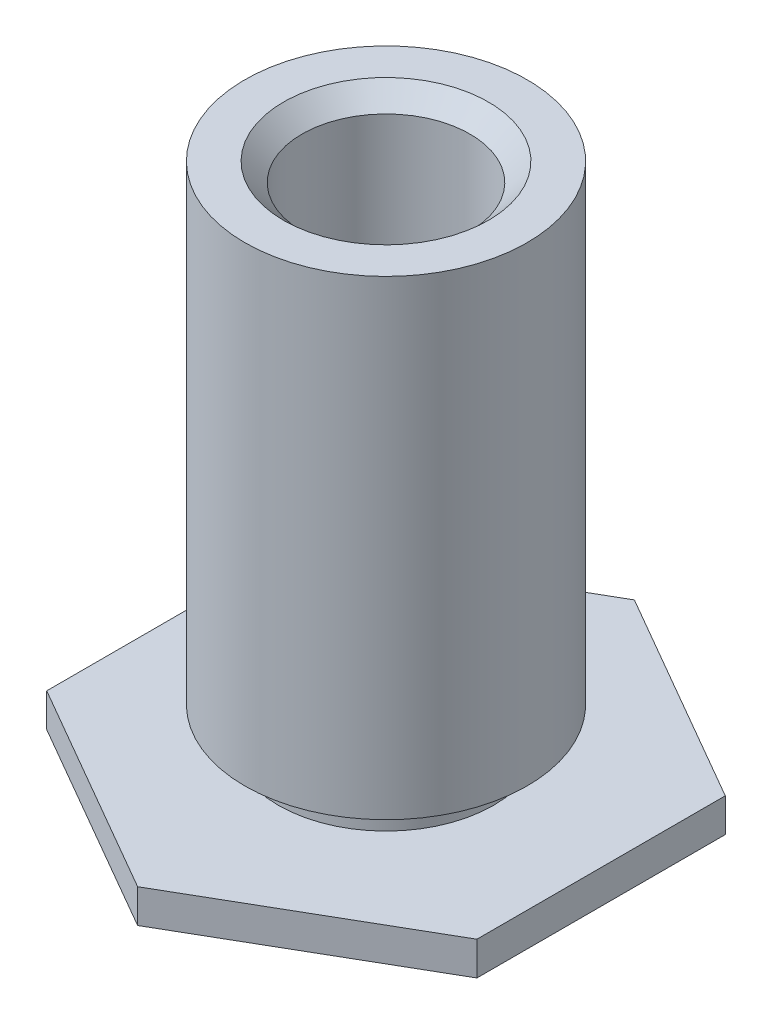
ISO-10303-21;
HEADER;
FILE_DESCRIPTION(('STEP AP214'),'2;1');
FILE_NAME('part.step','',(''),(''),'','','');
FILE_SCHEMA(('AUTOMOTIVE_DESIGN { 1 0 10303 214 1 1 1 1 }'));
ENDSEC;
DATA;
#1=APPLICATION_CONTEXT('core data for automotive mechanical design processes');
#2=APPLICATION_PROTOCOL_DEFINITION('international standard','automotive_design',2000,#1);
#3=PRODUCT_CONTEXT('',#1,'mechanical');
#4=PRODUCT('Part','Part','',(#3));
#5=PRODUCT_RELATED_PRODUCT_CATEGORY('part','',(#4));
#6=PRODUCT_DEFINITION_FORMATION('','',#4);
#7=PRODUCT_DEFINITION_CONTEXT('part definition',#1,'design');
#8=PRODUCT_DEFINITION('design','',#6,#7);
#9=PRODUCT_DEFINITION_SHAPE('','',#8);
#10=(LENGTH_UNIT() NAMED_UNIT(*) SI_UNIT(.MILLI.,.METRE.));
#11=(NAMED_UNIT(*) PLANE_ANGLE_UNIT() SI_UNIT($,.RADIAN.));
#12=(NAMED_UNIT(*) SI_UNIT($,.STERADIAN.) SOLID_ANGLE_UNIT());
#13=UNCERTAINTY_MEASURE_WITH_UNIT(LENGTH_MEASURE(1.E-05),#10,'distance_accuracy_value','');
#14=(GEOMETRIC_REPRESENTATION_CONTEXT(3) GLOBAL_UNCERTAINTY_ASSIGNED_CONTEXT((#13)) GLOBAL_UNIT_ASSIGNED_CONTEXT((#10,
#11,#12)) REPRESENTATION_CONTEXT('',''));
#15=CARTESIAN_POINT('',(0.,0.,0.));
#16=DIRECTION('',(0.,0.,1.));
#17=DIRECTION('',(1.,0.,0.));
#18=AXIS2_PLACEMENT_3D('',#15,#16,#17);
#19=CARTESIAN_POINT('',(0.,8.,0.));
#20=DIRECTION('',(0.,1.,0.));
#21=DIRECTION('',(0.,0.,1.));
#22=AXIS2_PLACEMENT_3D('',#19,#20,#21);
#23=PLANE('',#22);
#24=CARTESIAN_POINT('',(0.,8.,0.));
#25=DIRECTION('',(0.,1.,0.));
#26=DIRECTION('',(0.,0.,1.));
#27=AXIS2_PLACEMENT_3D('',#24,#25,#26);
#28=CIRCLE('',#27,1.525);
#29=CARTESIAN_POINT('',(0.,8.,1.525));
#30=VERTEX_POINT('',#29);
#31=EDGE_CURVE('E143',#30,#30,#28,.T.);
#32=ORIENTED_EDGE('',*,*,#31,.F.);
#33=EDGE_LOOP('',(#32));
#34=FACE_BOUND('',#33,.T.);
#35=CARTESIAN_POINT('',(0.,8.,0.));
#36=DIRECTION('',(0.,1.,0.));
#37=DIRECTION('',(0.,0.,1.));
#38=AXIS2_PLACEMENT_3D('',#35,#36,#37);
#39=CIRCLE('',#38,2.1);
#40=CARTESIAN_POINT('',(0.,8.,2.1));
#41=VERTEX_POINT('',#40);
#42=EDGE_CURVE('E146',#41,#41,#39,.T.);
#43=ORIENTED_EDGE('',*,*,#42,.T.);
#44=EDGE_LOOP('',(#43));
#45=FACE_BOUND('',#44,.T.);
#46=ADVANCED_FACE('F37',(#34,#45),#23,.T.);
#47=CARTESIAN_POINT('',(0.,0.5,0.));
#48=DIRECTION('',(0.,1.,0.));
#49=DIRECTION('',(0.,0.,1.));
#50=AXIS2_PLACEMENT_3D('',#47,#48,#49);
#51=PLANE('',#50);
#52=DIRECTION('',(-0.866025403784438,0.,0.5));
#53=VECTOR('',#52,1.);
#54=CARTESIAN_POINT('',(0.,0.5,3.69504172281361));
#55=LINE('',#54,#53);
#56=CARTESIAN_POINT('',(0.,0.5,3.69504172281361));
#57=VERTEX_POINT('',#56);
#58=CARTESIAN_POINT('',(3.2,0.5,1.8475208614068));
#59=VERTEX_POINT('',#58);
#60=EDGE_CURVE('E116',#57,#59,#55,.F.);
#61=ORIENTED_EDGE('',*,*,#60,.T.);
#62=DIRECTION('',(0.,0.,1.));
#63=VECTOR('',#62,1.);
#64=CARTESIAN_POINT('',(3.2,0.5,1.8475208614068));
#65=LINE('',#64,#63);
#66=CARTESIAN_POINT('',(3.2,0.5,-1.84752086140681));
#67=VERTEX_POINT('',#66);
#68=EDGE_CURVE('E121',#59,#67,#65,.F.);
#69=ORIENTED_EDGE('',*,*,#68,.T.);
#70=DIRECTION('',(0.866025403784439,0.,0.5));
#71=VECTOR('',#70,1.);
#72=CARTESIAN_POINT('',(3.2,0.5,-1.84752086140681));
#73=LINE('',#72,#71);
#74=CARTESIAN_POINT('',(0.,0.5,-3.69504172281361));
#75=VERTEX_POINT('',#74);
#76=EDGE_CURVE('E92',#67,#75,#73,.F.);
#77=ORIENTED_EDGE('',*,*,#76,.T.);
#78=DIRECTION('',(0.866025403784438,0.,-0.5));
#79=VECTOR('',#78,1.);
#80=CARTESIAN_POINT('',(0.,0.5,-3.69504172281361));
#81=LINE('',#80,#79);
#82=CARTESIAN_POINT('',(-3.2,0.5,-1.8475208614068));
#83=VERTEX_POINT('',#82);
#84=EDGE_CURVE('E41',#75,#83,#81,.F.);
#85=ORIENTED_EDGE('',*,*,#84,.T.);
#86=DIRECTION('',(0.,0.,-1.));
#87=VECTOR('',#86,1.);
#88=CARTESIAN_POINT('',(-3.2,0.5,-1.8475208614068));
#89=LINE('',#88,#87);
#90=CARTESIAN_POINT('',(-3.2,0.5,1.8475208614068));
#91=VERTEX_POINT('',#90);
#92=EDGE_CURVE('E88',#83,#91,#89,.F.);
#93=ORIENTED_EDGE('',*,*,#92,.T.);
#94=DIRECTION('',(-0.866025403784439,0.,-0.5));
#95=VECTOR('',#94,1.);
#96=CARTESIAN_POINT('',(-3.2,0.5,1.8475208614068));
#97=LINE('',#96,#95);
#98=EDGE_CURVE('E111',#91,#57,#97,.F.);
#99=ORIENTED_EDGE('',*,*,#98,.T.);
#100=EDGE_LOOP('',(#61,#69,#77,#85,#93,#99));
#101=FACE_BOUND('',#100,.T.);
#102=CARTESIAN_POINT('',(0.,0.5,0.));
#103=DIRECTION('',(0.,1.,0.));
#104=DIRECTION('',(0.,0.,1.));
#105=AXIS2_PLACEMENT_3D('',#102,#103,#104);
#106=CIRCLE('',#105,1.6);
#107=CARTESIAN_POINT('',(0.,0.5,1.6));
#108=VERTEX_POINT('',#107);
#109=EDGE_CURVE('E153',#108,#108,#106,.T.);
#110=ORIENTED_EDGE('',*,*,#109,.F.);
#111=EDGE_LOOP('',(#110));
#112=FACE_BOUND('',#111,.T.);
#113=ADVANCED_FACE('F39',(#101,#112),#51,.T.);
#114=CARTESIAN_POINT('',(0.,0.5,-3.69504172281361));
#115=DIRECTION('',(0.5,0.,0.866025403784438));
#116=DIRECTION('',(0.866025403784438,0.,-0.5));
#117=AXIS2_PLACEMENT_3D('',#114,#115,#116);
#118=PLANE('',#117);
#119=DIRECTION('',(0.,1.,0.));
#120=VECTOR('',#119,1.);
#121=CARTESIAN_POINT('',(-3.2,0.5,-1.8475208614068));
#122=LINE('',#121,#120);
#123=CARTESIAN_POINT('',(-3.2,0.,-1.8475208614068));
#124=VERTEX_POINT('',#123);
#125=EDGE_CURVE('E97',#124,#83,#122,.T.);
#126=ORIENTED_EDGE('',*,*,#125,.T.);
#127=ORIENTED_EDGE('',*,*,#84,.F.);
#128=DIRECTION('',(0.,1.,0.));
#129=VECTOR('',#128,1.);
#130=CARTESIAN_POINT('',(0.,0.5,-3.69504172281361));
#131=LINE('',#130,#129);
#132=CARTESIAN_POINT('',(0.,0.,-3.69504172281361));
#133=VERTEX_POINT('',#132);
#134=EDGE_CURVE('E125',#75,#133,#131,.F.);
#135=ORIENTED_EDGE('',*,*,#134,.T.);
#136=DIRECTION('',(-0.866025403784438,0.,0.5));
#137=VECTOR('',#136,1.);
#138=CARTESIAN_POINT('',(0.,0.,-3.69504172281361));
#139=LINE('',#138,#137);
#140=EDGE_CURVE('E108',#133,#124,#139,.T.);
#141=ORIENTED_EDGE('',*,*,#140,.T.);
#142=EDGE_LOOP('',(#126,#127,#135,#141));
#143=FACE_BOUND('',#142,.T.);
#144=ADVANCED_FACE('F107',(#143),#118,.F.);
#145=CARTESIAN_POINT('',(-3.2,0.5,-1.8475208614068));
#146=DIRECTION('',(1.,0.,0.));
#147=DIRECTION('',(0.,0.,-1.));
#148=AXIS2_PLACEMENT_3D('',#145,#146,#147);
#149=PLANE('',#148);
#150=DIRECTION('',(0.,1.,0.));
#151=VECTOR('',#150,1.);
#152=CARTESIAN_POINT('',(-3.2,0.5,1.8475208614068));
#153=LINE('',#152,#151);
#154=CARTESIAN_POINT('',(-3.2,0.,1.8475208614068));
#155=VERTEX_POINT('',#154);
#156=EDGE_CURVE('E104',#155,#91,#153,.T.);
#157=ORIENTED_EDGE('',*,*,#156,.T.);
#158=ORIENTED_EDGE('',*,*,#92,.F.);
#159=ORIENTED_EDGE('',*,*,#125,.F.);
#160=DIRECTION('',(0.,0.,1.));
#161=VECTOR('',#160,1.);
#162=CARTESIAN_POINT('',(-3.2,0.,0.));
#163=LINE('',#162,#161);
#164=EDGE_CURVE('E128',#124,#155,#163,.T.);
#165=ORIENTED_EDGE('',*,*,#164,.T.);
#166=EDGE_LOOP('',(#157,#158,#159,#165));
#167=FACE_BOUND('',#166,.T.);
#168=ADVANCED_FACE('F101',(#167),#149,.F.);
#169=CARTESIAN_POINT('',(-3.2,0.5,1.8475208614068));
#170=DIRECTION('',(0.5,0.,-0.866025403784439));
#171=DIRECTION('',(-0.866025403784439,0.,-0.5));
#172=AXIS2_PLACEMENT_3D('',#169,#170,#171);
#173=PLANE('',#172);
#174=DIRECTION('',(0.,1.,0.));
#175=VECTOR('',#174,1.);
#176=CARTESIAN_POINT('',(0.,0.5,3.69504172281361));
#177=LINE('',#176,#175);
#178=CARTESIAN_POINT('',(0.,0.,3.69504172281361));
#179=VERTEX_POINT('',#178);
#180=EDGE_CURVE('E113',#179,#57,#177,.T.);
#181=ORIENTED_EDGE('',*,*,#180,.T.);
#182=ORIENTED_EDGE('',*,*,#98,.F.);
#183=ORIENTED_EDGE('',*,*,#156,.F.);
#184=DIRECTION('',(0.866025403784439,0.,0.5));
#185=VECTOR('',#184,1.);
#186=CARTESIAN_POINT('',(-3.2,0.,1.8475208614068));
#187=LINE('',#186,#185);
#188=EDGE_CURVE('E130',#155,#179,#187,.T.);
#189=ORIENTED_EDGE('',*,*,#188,.T.);
#190=EDGE_LOOP('',(#181,#182,#183,#189));
#191=FACE_BOUND('',#190,.T.);
#192=ADVANCED_FACE('F202',(#191),#173,.F.);
#193=CARTESIAN_POINT('',(0.,0.5,3.69504172281361));
#194=DIRECTION('',(-0.5,0.,-0.866025403784438));
#195=DIRECTION('',(-0.866025403784438,0.,0.5));
#196=AXIS2_PLACEMENT_3D('',#193,#194,#195);
#197=PLANE('',#196);
#198=DIRECTION('',(0.,1.,0.));
#199=VECTOR('',#198,1.);
#200=CARTESIAN_POINT('',(3.2,0.5,1.8475208614068));
#201=LINE('',#200,#199);
#202=CARTESIAN_POINT('',(3.2,0.,1.8475208614068));
#203=VERTEX_POINT('',#202);
#204=EDGE_CURVE('E118',#203,#59,#201,.T.);
#205=ORIENTED_EDGE('',*,*,#204,.T.);
#206=ORIENTED_EDGE('',*,*,#60,.F.);
#207=ORIENTED_EDGE('',*,*,#180,.F.);
#208=DIRECTION('',(0.866025403784438,0.,-0.5));
#209=VECTOR('',#208,1.);
#210=CARTESIAN_POINT('',(0.,0.,3.69504172281361));
#211=LINE('',#210,#209);
#212=EDGE_CURVE('E133',#179,#203,#211,.T.);
#213=ORIENTED_EDGE('',*,*,#212,.T.);
#214=EDGE_LOOP('',(#205,#206,#207,#213));
#215=FACE_BOUND('',#214,.T.);
#216=ADVANCED_FACE('F198',(#215),#197,.F.);
#217=CARTESIAN_POINT('',(3.2,0.5,1.8475208614068));
#218=DIRECTION('',(-1.,0.,0.));
#219=DIRECTION('',(0.,0.,1.));
#220=AXIS2_PLACEMENT_3D('',#217,#218,#219);
#221=PLANE('',#220);
#222=DIRECTION('',(0.,1.,0.));
#223=VECTOR('',#222,1.);
#224=CARTESIAN_POINT('',(3.2,0.5,-1.84752086140681));
#225=LINE('',#224,#223);
#226=CARTESIAN_POINT('',(3.2,0.,-1.84752086140681));
#227=VERTEX_POINT('',#226);
#228=EDGE_CURVE('E55',#227,#67,#225,.T.);
#229=ORIENTED_EDGE('',*,*,#228,.T.);
#230=ORIENTED_EDGE('',*,*,#68,.F.);
#231=ORIENTED_EDGE('',*,*,#204,.F.);
#232=DIRECTION('',(0.,0.,1.));
#233=VECTOR('',#232,1.);
#234=CARTESIAN_POINT('',(3.2,0.,0.));
#235=LINE('',#234,#233);
#236=EDGE_CURVE('E47',#203,#227,#235,.F.);
#237=ORIENTED_EDGE('',*,*,#236,.T.);
#238=EDGE_LOOP('',(#229,#230,#231,#237));
#239=FACE_BOUND('',#238,.T.);
#240=ADVANCED_FACE('F195',(#239),#221,.F.);
#241=CARTESIAN_POINT('',(3.2,0.5,-1.84752086140681));
#242=DIRECTION('',(-0.5,0.,0.866025403784439));
#243=DIRECTION('',(0.866025403784439,0.,0.5));
#244=AXIS2_PLACEMENT_3D('',#241,#242,#243);
#245=PLANE('',#244);
#246=ORIENTED_EDGE('',*,*,#134,.F.);
#247=ORIENTED_EDGE('',*,*,#76,.F.);
#248=ORIENTED_EDGE('',*,*,#228,.F.);
#249=DIRECTION('',(-0.866025403784439,0.,-0.5));
#250=VECTOR('',#249,1.);
#251=CARTESIAN_POINT('',(3.2,0.,-1.84752086140681));
#252=LINE('',#251,#250);
#253=EDGE_CURVE('E11',#227,#133,#252,.T.);
#254=ORIENTED_EDGE('',*,*,#253,.T.);
#255=EDGE_LOOP('',(#246,#247,#248,#254));
#256=FACE_BOUND('',#255,.T.);
#257=ADVANCED_FACE('F186',(#256),#245,.F.);
#258=CARTESIAN_POINT('',(0.,0.,0.));
#259=DIRECTION('',(0.,1.,0.));
#260=DIRECTION('',(0.,0.,1.));
#261=AXIS2_PLACEMENT_3D('',#258,#259,#260);
#262=PLANE('',#261);
#263=CARTESIAN_POINT('',(0.,0.,0.));
#264=DIRECTION('',(0.,1.,0.));
#265=DIRECTION('',(0.,0.,1.));
#266=AXIS2_PLACEMENT_3D('',#263,#264,#265);
#267=CIRCLE('',#266,1.25);
#268=CARTESIAN_POINT('',(0.,0.,1.25));
#269=VERTEX_POINT('',#268);
#270=EDGE_CURVE('E98',#269,#269,#267,.T.);
#271=ORIENTED_EDGE('',*,*,#270,.T.);
#272=EDGE_LOOP('',(#271));
#273=FACE_BOUND('',#272,.T.);
#274=ORIENTED_EDGE('',*,*,#236,.F.);
#275=ORIENTED_EDGE('',*,*,#212,.F.);
#276=ORIENTED_EDGE('',*,*,#188,.F.);
#277=ORIENTED_EDGE('',*,*,#164,.F.);
#278=ORIENTED_EDGE('',*,*,#140,.F.);
#279=ORIENTED_EDGE('',*,*,#253,.F.);
#280=EDGE_LOOP('',(#274,#275,#276,#277,#278,#279));
#281=FACE_BOUND('',#280,.T.);
#282=ADVANCED_FACE('F174',(#273,#281),#262,.F.);
#283=CARTESIAN_POINT('',(0.,8.,0.));
#284=DIRECTION('',(0.,1.,0.));
#285=DIRECTION('',(0.,0.,1.));
#286=AXIS2_PLACEMENT_3D('',#283,#284,#285);
#287=CYLINDRICAL_SURFACE('',#286,1.25);
#288=ORIENTED_EDGE('',*,*,#270,.F.);
#289=EDGE_LOOP('',(#288));
#290=FACE_BOUND('',#289,.T.);
#291=CARTESIAN_POINT('',(0.,7.725,0.));
#292=DIRECTION('',(0.,1.,0.));
#293=DIRECTION('',(0.,0.,1.));
#294=AXIS2_PLACEMENT_3D('',#291,#292,#293);
#295=CIRCLE('',#294,1.25);
#296=CARTESIAN_POINT('',(0.,7.725,1.25));
#297=VERTEX_POINT('',#296);
#298=EDGE_CURVE('E140',#297,#297,#295,.T.);
#299=ORIENTED_EDGE('',*,*,#298,.T.);
#300=EDGE_LOOP('',(#299));
#301=FACE_BOUND('',#300,.T.);
#302=ADVANCED_FACE('F167',(#290,#301),#287,.F.);
#303=CARTESIAN_POINT('',(0.,8.,0.));
#304=DIRECTION('',(0.,1.,0.));
#305=DIRECTION('',(0.,0.,1.));
#306=AXIS2_PLACEMENT_3D('',#303,#304,#305);
#307=CONICAL_SURFACE('',#306,1.525,0.785398163397446);
#308=ORIENTED_EDGE('',*,*,#298,.F.);
#309=EDGE_LOOP('',(#308));
#310=FACE_BOUND('',#309,.T.);
#311=ORIENTED_EDGE('',*,*,#31,.T.);
#312=EDGE_LOOP('',(#311));
#313=FACE_BOUND('',#312,.T.);
#314=ADVANCED_FACE('F176',(#310,#313),#307,.F.);
#315=CARTESIAN_POINT('',(0.,-7.12261110119098,0.));
#316=DIRECTION('',(0.,1.,0.));
#317=DIRECTION('',(0.,0.,1.));
#318=AXIS2_PLACEMENT_3D('',#315,#316,#317);
#319=CYLINDRICAL_SURFACE('',#318,2.1);
#320=CARTESIAN_POINT('',(0.,1.,0.));
#321=DIRECTION('',(0.,1.,0.));
#322=DIRECTION('',(0.,0.,1.));
#323=AXIS2_PLACEMENT_3D('',#320,#321,#322);
#324=CIRCLE('',#323,2.1);
#325=CARTESIAN_POINT('',(0.,1.,2.1));
#326=VERTEX_POINT('',#325);
#327=EDGE_CURVE('E149',#326,#326,#324,.T.);
#328=ORIENTED_EDGE('',*,*,#327,.T.);
#329=EDGE_LOOP('',(#328));
#330=FACE_BOUND('',#329,.T.);
#331=ORIENTED_EDGE('',*,*,#42,.F.);
#332=EDGE_LOOP('',(#331));
#333=FACE_BOUND('',#332,.T.);
#334=ADVANCED_FACE('F183',(#330,#333),#319,.T.);
#335=CARTESIAN_POINT('',(0.,1.,0.));
#336=DIRECTION('',(0.,1.,0.));
#337=DIRECTION('',(0.,0.,1.));
#338=AXIS2_PLACEMENT_3D('',#335,#336,#337);
#339=PLANE('',#338);
#340=ORIENTED_EDGE('',*,*,#327,.F.);
#341=EDGE_LOOP('',(#340));
#342=FACE_BOUND('',#341,.T.);
#343=CARTESIAN_POINT('',(0.,1.,0.));
#344=DIRECTION('',(0.,1.,0.));
#345=DIRECTION('',(0.,0.,1.));
#346=AXIS2_PLACEMENT_3D('',#343,#344,#345);
#347=CIRCLE('',#346,1.6);
#348=CARTESIAN_POINT('',(0.,1.,1.6));
#349=VERTEX_POINT('',#348);
#350=EDGE_CURVE('E152',#349,#349,#347,.T.);
#351=ORIENTED_EDGE('',*,*,#350,.T.);
#352=EDGE_LOOP('',(#351));
#353=FACE_BOUND('',#352,.T.);
#354=ADVANCED_FACE('F159',(#342,#353),#339,.F.);
#355=CARTESIAN_POINT('',(0.,1.,0.));
#356=DIRECTION('',(0.,-1.,0.));
#357=DIRECTION('',(0.,0.,-1.));
#358=AXIS2_PLACEMENT_3D('',#355,#356,#357);
#359=CYLINDRICAL_SURFACE('',#358,1.6);
#360=ORIENTED_EDGE('',*,*,#350,.F.);
#361=EDGE_LOOP('',(#360));
#362=FACE_BOUND('',#361,.T.);
#363=ORIENTED_EDGE('',*,*,#109,.T.);
#364=EDGE_LOOP('',(#363));
#365=FACE_BOUND('',#364,.T.);
#366=ADVANCED_FACE('F161',(#362,#365),#359,.T.);
#367=CLOSED_SHELL('',(#46,#113,#144,#168,#192,#216,#240,#257,#282,#302,#314,#334,#354,#366));
#368=MANIFOLD_SOLID_BREP('B2',#367);
#369=ADVANCED_BREP_SHAPE_REPRESENTATION('',(#18,#368),#14);
#370=SHAPE_DEFINITION_REPRESENTATION(#9,#369);
ENDSEC;
END-ISO-10303-21;
